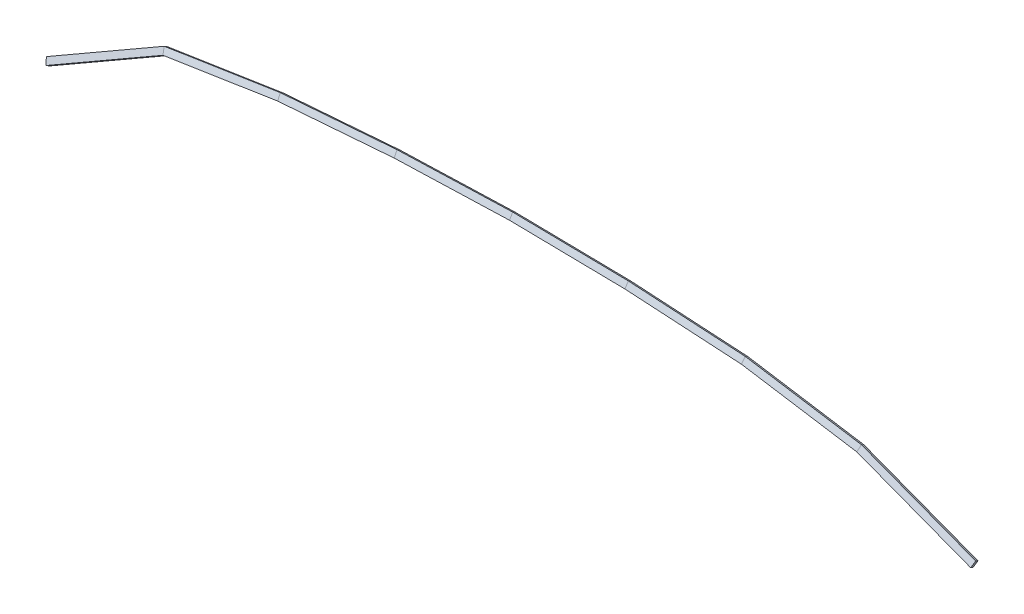
ISO-10303-21;
HEADER;
FILE_DESCRIPTION(('STEP AP214'),'2;1');
FILE_NAME('part.step','',(''),(''),'','','');
FILE_SCHEMA(('AUTOMOTIVE_DESIGN { 1 0 10303 214 1 1 1 1 }'));
ENDSEC;
DATA;
#1=APPLICATION_CONTEXT('core data for automotive mechanical design processes');
#2=APPLICATION_PROTOCOL_DEFINITION('international standard','automotive_design',2000,#1);
#3=PRODUCT_CONTEXT('',#1,'mechanical');
#4=PRODUCT('Part','Part','',(#3));
#5=PRODUCT_RELATED_PRODUCT_CATEGORY('part','',(#4));
#6=PRODUCT_DEFINITION_FORMATION('','',#4);
#7=PRODUCT_DEFINITION_CONTEXT('part definition',#1,'design');
#8=PRODUCT_DEFINITION('design','',#6,#7);
#9=PRODUCT_DEFINITION_SHAPE('','',#8);
#10=(LENGTH_UNIT() NAMED_UNIT(*) SI_UNIT(.MILLI.,.METRE.));
#11=(NAMED_UNIT(*) PLANE_ANGLE_UNIT() SI_UNIT($,.RADIAN.));
#12=(NAMED_UNIT(*) SI_UNIT($,.STERADIAN.) SOLID_ANGLE_UNIT());
#13=UNCERTAINTY_MEASURE_WITH_UNIT(LENGTH_MEASURE(1.E-05),#10,'distance_accuracy_value','');
#14=(GEOMETRIC_REPRESENTATION_CONTEXT(3) GLOBAL_UNCERTAINTY_ASSIGNED_CONTEXT((#13)) GLOBAL_UNIT_ASSIGNED_CONTEXT((#10,
#11,#12)) REPRESENTATION_CONTEXT('',''));
#15=CARTESIAN_POINT('',(0.,0.,0.));
#16=DIRECTION('',(0.,0.,1.));
#17=DIRECTION('',(1.,0.,0.));
#18=AXIS2_PLACEMENT_3D('',#15,#16,#17);
#19=CARTESIAN_POINT('',(-784.907028910568,-160.718556902438,0.));
#20=DIRECTION('',(-0.85855089776077,-0.512728345183076,0.));
#21=DIRECTION('',(0.,0.,1.));
#22=AXIS2_PLACEMENT_3D('',#19,#20,#21);
#23=PLANE('',#22);
#24=DIRECTION('',(0.4440357721689,-0.743526887902763,0.500000000000001));
#25=VECTOR('',#24,1.);
#26=CARTESIAN_POINT('',(-779.465086610704,-169.830954317179,138.5316));
#27=LINE('',#26,#25);
#28=CARTESIAN_POINT('',(-784.066718124844,-162.125636472466,133.35));
#29=VERTEX_POINT('',#28);
#30=CARTESIAN_POINT('',(-779.465086610704,-169.830954317179,138.5316));
#31=VERTEX_POINT('',#30);
#32=EDGE_CURVE('E181',#29,#31,#27,.T.);
#33=ORIENTED_EDGE('',*,*,#32,.F.);
#34=DIRECTION('',(-0.256364172591538,0.429275448880385,0.866025403784439));
#35=VECTOR('',#34,1.);
#36=CARTESIAN_POINT('',(-784.066718124845,-162.125636472466,133.35));
#37=LINE('',#36,#35);
#38=CARTESIAN_POINT('',(-782.705783278225,-164.404488120392,128.75261754147));
#39=VERTEX_POINT('',#38);
#40=EDGE_CURVE('E155',#39,#29,#37,.T.);
#41=ORIENTED_EDGE('',*,*,#40,.F.);
#42=DIRECTION('',(-0.4440357721689,0.743526887902762,-0.500000000000003));
#43=VECTOR('',#42,1.);
#44=CARTESIAN_POINT('',(-782.705783278225,-164.404488120392,128.75261754147));
#45=LINE('',#44,#43);
#46=CARTESIAN_POINT('',(-778.104151764084,-172.109805965106,133.93421754147));
#47=VERTEX_POINT('',#46);
#48=EDGE_CURVE('E139',#47,#39,#45,.T.);
#49=ORIENTED_EDGE('',*,*,#48,.F.);
#50=DIRECTION('',(0.256364172591539,-0.429275448880386,-0.866025403784438));
#51=VECTOR('',#50,1.);
#52=CARTESIAN_POINT('',(-778.104151764084,-172.109805965106,133.93421754147));
#53=LINE('',#52,#51);
#54=EDGE_CURVE('E146',#31,#47,#53,.T.);
#55=ORIENTED_EDGE('',*,*,#54,.F.);
#56=EDGE_LOOP('',(#33,#41,#49,#55));
#57=FACE_BOUND('',#56,.T.);
#58=ADVANCED_FACE('F32',(#57),#23,.T.);
#59=CARTESIAN_POINT('',(734.039201723377,-115.1225877107,0.));
#60=DIRECTION('',(-0.940025323565128,0.341104662906088,0.));
#61=DIRECTION('',(0.,0.,1.));
#62=AXIS2_PLACEMENT_3D('',#59,#60,#61);
#63=PLANE('',#62);
#64=DIRECTION('',(-0.295405303425999,-0.814085810408087,0.500000000000001));
#65=VECTOR('',#64,1.);
#66=CARTESIAN_POINT('',(730.41882085076,-125.099729835398,138.5316));
#67=LINE('',#66,#65);
#68=CARTESIAN_POINT('',(733.480165091224,-116.663195764977,133.35));
#69=VERTEX_POINT('',#68);
#70=CARTESIAN_POINT('',(730.41882085076,-125.099729835398,138.5316));
#71=VERTEX_POINT('',#70);
#72=EDGE_CURVE('E334',#69,#71,#67,.T.);
#73=ORIENTED_EDGE('',*,*,#72,.T.);
#74=DIRECTION('',(-0.170552331453044,-0.470012661782565,-0.866025403784438));
#75=VECTOR('',#74,1.);
#76=CARTESIAN_POINT('',(729.513426744008,-127.594839051737,133.93421754147));
#77=LINE('',#76,#75);
#78=CARTESIAN_POINT('',(729.513426744008,-127.594839051737,133.93421754147));
#79=VERTEX_POINT('',#78);
#80=EDGE_CURVE('E330',#71,#79,#77,.T.);
#81=ORIENTED_EDGE('',*,*,#80,.T.);
#82=DIRECTION('',(0.295405303425999,0.814085810408086,-0.500000000000003));
#83=VECTOR('',#82,1.);
#84=CARTESIAN_POINT('',(732.574770984472,-119.158304981316,128.75261754147));
#85=LINE('',#84,#83);
#86=CARTESIAN_POINT('',(732.574770984472,-119.158304981316,128.75261754147));
#87=VERTEX_POINT('',#86);
#88=EDGE_CURVE('E324',#79,#87,#85,.T.);
#89=ORIENTED_EDGE('',*,*,#88,.T.);
#90=DIRECTION('',(0.170552331453044,0.470012661782564,0.866025403784439));
#91=VECTOR('',#90,1.);
#92=CARTESIAN_POINT('',(733.480165091224,-116.663195764977,133.35));
#93=LINE('',#92,#91);
#94=EDGE_CURVE('E340',#87,#69,#93,.T.);
#95=ORIENTED_EDGE('',*,*,#94,.T.);
#96=EDGE_LOOP('',(#73,#81,#89,#95));
#97=FACE_BOUND('',#96,.T.);
#98=ADVANCED_FACE('F390',(#97),#63,.F.);
#99=CARTESIAN_POINT('',(-590.188768908383,-53.5305624373658,128.75261754147));
#100=DIRECTION('',(-0.24955774335446,0.433322003956346,0.865998252665146));
#101=DIRECTION('',(0.,-0.894293780309085,0.447480317444786));
#102=AXIS2_PLACEMENT_3D('',#99,#100,#101);
#103=PLANE('',#102);
#104=DIRECTION('',(0.288071481331298,-0.820585596833462,0.49361331010525));
#105=VECTOR('',#104,1.);
#106=CARTESIAN_POINT('',(-581.851798674786,-78.8824490882621,143.840506882284));
#107=LINE('',#106,#105);
#108=CARTESIAN_POINT('',(-590.657052794948,-53.8002553422112,128.75261754147));
#109=VERTEX_POINT('',#108);
#110=CARTESIAN_POINT('',(-587.633084119249,-62.4141768907321,133.93421754147));
#111=VERTEX_POINT('',#110);
#112=EDGE_CURVE('E160',#109,#111,#107,.T.);
#113=ORIENTED_EDGE('',*,*,#112,.T.);
#114=DIRECTION('',(-0.866562509147822,-0.49906855014059,0.));
#115=VECTOR('',#114,1.);
#116=CARTESIAN_POINT('',(-585.587137394242,-61.2358802820797,133.93421754147));
#117=LINE('',#116,#115);
#118=EDGE_CURVE('E35',#111,#47,#117,.T.);
#119=ORIENTED_EDGE('',*,*,#118,.T.);
#120=ORIENTED_EDGE('',*,*,#48,.T.);
#121=DIRECTION('',(-0.866562509147822,-0.49906855014059,0.));
#122=VECTOR('',#121,1.);
#123=CARTESIAN_POINT('',(-590.188768908383,-53.5305624373658,128.75261754147));
#124=LINE('',#123,#122);
#125=EDGE_CURVE('E157',#109,#39,#124,.T.);
#126=ORIENTED_EDGE('',*,*,#125,.F.);
#127=EDGE_LOOP('',(#113,#119,#120,#126));
#128=FACE_BOUND('',#127,.T.);
#129=ADVANCED_FACE('F159',(#128),#103,.F.);
#130=CARTESIAN_POINT('',(-591.549703755002,-51.2517107894394,133.35));
#131=DIRECTION('',(0.432219590797591,-0.750488671343633,0.499952977304497));
#132=DIRECTION('',(0.,-0.554413953781299,-0.832241051530497));
#133=AXIS2_PLACEMENT_3D('',#130,#131,#132);
#134=PLANE('',#133);
#135=DIRECTION('',(0.167743514626364,-0.477825543259226,-0.86229047513574));
#136=VECTOR('',#135,1.);
#137=CARTESIAN_POINT('',(-588.558688120008,-59.7775489680914,117.965912156216));
#138=LINE('',#137,#136);
#139=CARTESIAN_POINT('',(-591.551393059525,-51.2526836895477,133.35));
#140=VERTEX_POINT('',#139);
#141=EDGE_CURVE('E191',#140,#109,#138,.T.);
#142=ORIENTED_EDGE('',*,*,#141,.T.);
#143=ORIENTED_EDGE('',*,*,#125,.T.);
#144=ORIENTED_EDGE('',*,*,#40,.T.);
#145=DIRECTION('',(-0.866562509147822,-0.49906855014059,0.));
#146=VECTOR('',#145,1.);
#147=CARTESIAN_POINT('',(-591.549703755002,-51.2517107894394,133.35));
#148=LINE('',#147,#146);
#149=EDGE_CURVE('E183',#140,#29,#148,.T.);
#150=ORIENTED_EDGE('',*,*,#149,.F.);
#151=EDGE_LOOP('',(#142,#143,#144,#150));
#152=FACE_BOUND('',#151,.T.);
#153=ADVANCED_FACE('F189',(#152),#134,.F.);
#154=CARTESIAN_POINT('',(-586.948072240862,-58.9570286341533,138.5316));
#155=DIRECTION('',(0.249557743354459,-0.433322003956344,-0.865998252665147));
#156=DIRECTION('',(0.,0.894293780309086,-0.447480317444783));
#157=AXIS2_PLACEMENT_3D('',#154,#155,#156);
#158=PLANE('',#157);
#159=DIRECTION('',(-0.288071481331298,0.820585596833464,-0.493613310105248));
#160=VECTOR('',#159,1.);
#161=CARTESIAN_POINT('',(-579.772008054505,-84.80683361791,153.534091797151));
#162=LINE('',#161,#160);
#163=CARTESIAN_POINT('',(-588.527424383826,-59.8666052380685,138.5316));
#164=VERTEX_POINT('',#163);
#165=EDGE_CURVE('E196',#164,#140,#162,.T.);
#166=ORIENTED_EDGE('',*,*,#165,.T.);
#167=ORIENTED_EDGE('',*,*,#149,.T.);
#168=ORIENTED_EDGE('',*,*,#32,.T.);
#169=DIRECTION('',(-0.866562509147822,-0.49906855014059,0.));
#170=VECTOR('',#169,1.);
#171=CARTESIAN_POINT('',(-586.948072240862,-58.9570286341533,138.5316));
#172=LINE('',#171,#170);
#173=EDGE_CURVE('E151',#164,#31,#172,.T.);
#174=ORIENTED_EDGE('',*,*,#173,.F.);
#175=EDGE_LOOP('',(#166,#167,#168,#174));
#176=FACE_BOUND('',#175,.T.);
#177=ADVANCED_FACE('F495',(#176),#158,.F.);
#178=CARTESIAN_POINT('',(-585.587137394242,-61.2358802820797,133.93421754147));
#179=DIRECTION('',(-0.43221959079759,0.750488671343633,-0.499952977304499));
#180=DIRECTION('',(0.,0.5544139537813,0.832241051530496));
#181=AXIS2_PLACEMENT_3D('',#178,#179,#180);
#182=PLANE('',#181);
#183=DIRECTION('',(-0.167743514626364,0.477825543259227,0.86229047513574));
#184=VECTOR('',#183,1.);
#185=CARTESIAN_POINT('',(-584.671470887062,-70.8504759318344,118.709957534523));
#186=LINE('',#185,#184);
#187=EDGE_CURVE('E173',#111,#164,#186,.T.);
#188=ORIENTED_EDGE('',*,*,#187,.T.);
#189=ORIENTED_EDGE('',*,*,#173,.T.);
#190=ORIENTED_EDGE('',*,*,#54,.T.);
#191=ORIENTED_EDGE('',*,*,#118,.F.);
#192=EDGE_LOOP('',(#188,#189,#190,#191));
#193=FACE_BOUND('',#192,.T.);
#194=ADVANCED_FACE('F148',(#193),#182,.F.);
#195=CARTESIAN_POINT('',(-400.213670553241,-33.5693686646191,133.93421754147));
#196=DIRECTION('',(-0.131738822515146,0.855974242093003,-0.499952977304498));
#197=DIRECTION('',(0.,0.504348647606648,0.863500110977031));
#198=AXIS2_PLACEMENT_3D('',#195,#196,#197);
#199=PLANE('',#198);
#200=DIRECTION('',(-0.988362936466477,-0.152114121038654,0.));
#201=VECTOR('',#200,1.);
#202=CARTESIAN_POINT('',(-400.213670553241,-33.5693686646191,133.93421754147));
#203=LINE('',#202,#201);
#204=CARTESIAN_POINT('',(-400.83543014905,-33.6650606527787,133.93421754147));
#205=VERTEX_POINT('',#204);
#206=EDGE_CURVE('E178',#205,#111,#203,.T.);
#207=ORIENTED_EDGE('',*,*,#206,.F.);
#208=DIRECTION('',(-0.0571535888943356,0.496950910960597,0.865894485126179));
#209=VECTOR('',#208,1.);
#210=CARTESIAN_POINT('',(-400.626825744216,-35.4788776154188,130.773796521328));
#211=LINE('',#210,#209);
#212=CARTESIAN_POINT('',(-401.138881564364,-31.026548178054,138.5316));
#213=VERTEX_POINT('',#212);
#214=EDGE_CURVE('E210',#205,#213,#211,.T.);
#215=ORIENTED_EDGE('',*,*,#214,.T.);
#216=DIRECTION('',(-0.988362936466477,-0.152114121038654,0.));
#217=VECTOR('',#216,1.);
#218=CARTESIAN_POINT('',(-400.658919237855,-30.9526795163155,138.5316));
#219=LINE('',#218,#217);
#220=EDGE_CURVE('E162',#213,#164,#219,.T.);
#221=ORIENTED_EDGE('',*,*,#220,.T.);
#222=ORIENTED_EDGE('',*,*,#187,.F.);
#223=EDGE_LOOP('',(#207,#215,#221,#222));
#224=FACE_BOUND('',#223,.T.);
#225=ADVANCED_FACE('F209',(#224),#199,.F.);
#226=CARTESIAN_POINT('',(-400.658919237855,-30.9526795163155,138.5316));
#227=DIRECTION('',(0.0760642135595595,-0.494227945179628,-0.865998252665147));
#228=DIRECTION('',(0.,0.868514407363995,-0.495663922634246));
#229=AXIS2_PLACEMENT_3D('',#226,#227,#228);
#230=PLANE('',#229);
#231=ORIENTED_EDGE('',*,*,#220,.F.);
#232=DIRECTION('',(-0.0989630057422614,0.860484123681859,-0.499773345013438));
#233=VECTOR('',#232,1.);
#234=CARTESIAN_POINT('',(-400.513252044295,-36.4664018414393,141.691093344399));
#235=LINE('',#234,#233);
#236=CARTESIAN_POINT('',(-402.164920098973,-22.1051349419199,133.35));
#237=VERTEX_POINT('',#236);
#238=EDGE_CURVE('E224',#213,#237,#235,.T.);
#239=ORIENTED_EDGE('',*,*,#238,.T.);
#240=DIRECTION('',(-0.988362936466477,-0.152114121038654,0.));
#241=VECTOR('',#240,1.);
#242=CARTESIAN_POINT('',(-402.164406722313,-22.1050559306209,133.35));
#243=LINE('',#242,#241);
#244=EDGE_CURVE('E164',#237,#140,#243,.T.);
#245=ORIENTED_EDGE('',*,*,#244,.T.);
#246=ORIENTED_EDGE('',*,*,#165,.F.);
#247=EDGE_LOOP('',(#231,#239,#245,#246));
#248=FACE_BOUND('',#247,.T.);
#249=ADVANCED_FACE('F487',(#248),#230,.F.);
#250=CARTESIAN_POINT('',(-402.164406722313,-22.1050559306209,133.35));
#251=DIRECTION('',(0.131738822515146,-0.855974242093004,0.499952977304497));
#252=DIRECTION('',(0.,-0.504348647606647,-0.863500110977032));
#253=AXIS2_PLACEMENT_3D('',#250,#251,#252);
#254=PLANE('',#253);
#255=ORIENTED_EDGE('',*,*,#244,.F.);
#256=DIRECTION('',(0.0571535888943355,-0.496950910960596,-0.86589448512618));
#257=VECTOR('',#256,1.);
#258=CARTESIAN_POINT('',(-401.956031517079,-23.9214228263704,130.185273609807));
#259=LINE('',#258,#257);
#260=CARTESIAN_POINT('',(-401.861468683658,-24.7436474166446,128.75261754147));
#261=VERTEX_POINT('',#260);
#262=EDGE_CURVE('E201',#237,#261,#259,.T.);
#263=ORIENTED_EDGE('',*,*,#262,.T.);
#264=DIRECTION('',(-0.988362936466477,-0.152114121038654,0.));
#265=VECTOR('',#264,1.);
#266=CARTESIAN_POINT('',(-401.719158037699,-24.7217450789245,128.75261754147));
#267=LINE('',#266,#265);
#268=EDGE_CURVE('E170',#261,#109,#267,.T.);
#269=ORIENTED_EDGE('',*,*,#268,.T.);
#270=ORIENTED_EDGE('',*,*,#141,.F.);
#271=EDGE_LOOP('',(#255,#263,#269,#270));
#272=FACE_BOUND('',#271,.T.);
#273=ADVANCED_FACE('F200',(#272),#254,.F.);
#274=CARTESIAN_POINT('',(-401.719158037699,-24.7217450789245,128.75261754147));
#275=DIRECTION('',(-0.0760642135595598,0.49422794517963,0.865998252665146));
#276=DIRECTION('',(0.,-0.868514407363994,0.495663922634248));
#277=AXIS2_PLACEMENT_3D('',#274,#275,#276);
#278=PLANE('',#277);
#279=ORIENTED_EDGE('',*,*,#268,.F.);
#280=DIRECTION('',(0.0989630057422613,-0.860484123681857,0.49977334501344));
#281=VECTOR('',#280,1.);
#282=CARTESIAN_POINT('',(-401.235376086902,-30.1875275355083,131.914449470704));
#283=LINE('',#282,#281);
#284=EDGE_CURVE('E206',#261,#205,#283,.T.);
#285=ORIENTED_EDGE('',*,*,#284,.T.);
#286=ORIENTED_EDGE('',*,*,#206,.T.);
#287=ORIENTED_EDGE('',*,*,#112,.F.);
#288=EDGE_LOOP('',(#279,#285,#286,#287));
#289=FACE_BOUND('',#288,.T.);
#290=ADVANCED_FACE('F205',(#289),#278,.F.);
#291=CARTESIAN_POINT('',(-210.345153947005,-19.1016276043959,133.93421754147));
#292=DIRECTION('',(-0.0660191113265195,0.86353256882646,-0.499952977304498));
#293=DIRECTION('',(0.,0.501046080130912,0.865420606171039));
#294=AXIS2_PLACEMENT_3D('',#291,#292,#293);
#295=PLANE('',#294);
#296=DIRECTION('',(-0.997090266843599,-0.0762299138511886,0.));
#297=VECTOR('',#296,1.);
#298=CARTESIAN_POINT('',(-210.345153947005,-19.1016276043959,133.93421754147));
#299=LINE('',#298,#297);
#300=CARTESIAN_POINT('',(-210.779861167201,-19.1348620015692,133.93421754147));
#301=VERTEX_POINT('',#300);
#302=EDGE_CURVE('E215',#301,#205,#299,.T.);
#303=ORIENTED_EDGE('',*,*,#302,.F.);
#304=DIRECTION('',(-0.0273290341594202,0.499293276973071,0.86600193271228));
#305=VECTOR('',#304,1.);
#306=CARTESIAN_POINT('',(-210.724080433556,-20.1539593151073,132.166638677809));
#307=LINE('',#306,#305);
#308=CARTESIAN_POINT('',(-210.924944009983,-16.4842418741652,138.5316));
#309=VERTEX_POINT('',#308);
#310=EDGE_CURVE('E232',#301,#309,#307,.T.);
#311=ORIENTED_EDGE('',*,*,#310,.T.);
#312=DIRECTION('',(-0.997090266843599,-0.0762299138511886,0.));
#313=VECTOR('',#312,1.);
#314=CARTESIAN_POINT('',(-210.589375262573,-16.4585868481793,138.5316));
#315=LINE('',#314,#313);
#316=EDGE_CURVE('E195',#309,#213,#315,.T.);
#317=ORIENTED_EDGE('',*,*,#316,.T.);
#318=ORIENTED_EDGE('',*,*,#214,.F.);
#319=EDGE_LOOP('',(#303,#311,#317,#318));
#320=FACE_BOUND('',#319,.T.);
#321=ADVANCED_FACE('F478',(#320),#295,.F.);
#322=CARTESIAN_POINT('',(-210.589375262573,-16.4585868481793,138.5316));
#323=DIRECTION('',(0.0381185415739948,-0.498592020763653,-0.865998252665147));
#324=DIRECTION('',(0.,0.866628096913272,-0.498954648881519));
#325=AXIS2_PLACEMENT_3D('',#322,#323,#324);
#326=PLANE('',#325);
#327=ORIENTED_EDGE('',*,*,#316,.F.);
#328=DIRECTION('',(-0.047332710162327,0.86475445224685,-0.499959350215535));
#329=VECTOR('',#328,1.);
#330=CARTESIAN_POINT('',(-210.75760633086,-19.5414512026457,140.299131101307));
#331=LINE('',#330,#329);
#332=CARTESIAN_POINT('',(-211.415502234109,-7.52188989928847,133.35));
#333=VERTEX_POINT('',#332);
#334=EDGE_CURVE('E246',#309,#333,#331,.T.);
#335=ORIENTED_EDGE('',*,*,#334,.T.);
#336=DIRECTION('',(-0.997090266843599,-0.0762299138511886,0.));
#337=VECTOR('',#336,1.);
#338=CARTESIAN_POINT('',(-211.415143303516,-7.52186245819396,133.35));
#339=LINE('',#338,#337);
#340=EDGE_CURVE('E219',#333,#237,#339,.T.);
#341=ORIENTED_EDGE('',*,*,#340,.T.);
#342=ORIENTED_EDGE('',*,*,#238,.F.);
#343=EDGE_LOOP('',(#327,#335,#341,#342));
#344=FACE_BOUND('',#343,.T.);
#345=ADVANCED_FACE('F474',(#344),#326,.F.);
#346=CARTESIAN_POINT('',(-211.415143303516,-7.52186245819396,133.35));
#347=DIRECTION('',(0.0660191113265195,-0.86353256882646,0.499952977304497));
#348=DIRECTION('',(0.,-0.501046080130911,-0.865420606171039));
#349=AXIS2_PLACEMENT_3D('',#346,#347,#348);
#350=PLANE('',#349);
#351=ORIENTED_EDGE('',*,*,#340,.F.);
#352=DIRECTION('',(0.0273290341594201,-0.49929327697307,-0.866001932712281));
#353=VECTOR('',#352,1.);
#354=CARTESIAN_POINT('',(-211.359701611548,-8.54135057738178,131.581790896715));
#355=LINE('',#354,#353);
#356=CARTESIAN_POINT('',(-211.270419391327,-10.1725100266925,128.75261754147));
#357=VERTEX_POINT('',#356);
#358=EDGE_CURVE('E249',#333,#357,#355,.T.);
#359=ORIENTED_EDGE('',*,*,#358,.T.);
#360=DIRECTION('',(-0.997090266843599,-0.0762299138511886,0.));
#361=VECTOR('',#360,1.);
#362=CARTESIAN_POINT('',(-211.170921987947,-10.1649032144106,128.75261754147));
#363=LINE('',#362,#361);
#364=EDGE_CURVE('E217',#357,#261,#363,.T.);
#365=ORIENTED_EDGE('',*,*,#364,.T.);
#366=ORIENTED_EDGE('',*,*,#262,.F.);
#367=EDGE_LOOP('',(#351,#359,#365,#366));
#368=FACE_BOUND('',#367,.T.);
#369=ADVANCED_FACE('F470',(#368),#350,.F.);
#370=CARTESIAN_POINT('',(-211.170921987947,-10.1649032144106,128.75261754147));
#371=DIRECTION('',(-0.038118541573995,0.498592020763656,0.865998252665146));
#372=DIRECTION('',(0.,-0.866628096913271,0.498954648881521));
#373=AXIS2_PLACEMENT_3D('',#370,#371,#372);
#374=PLANE('',#373);
#375=ORIENTED_EDGE('',*,*,#364,.F.);
#376=DIRECTION('',(0.047332710162327,-0.864754452246848,0.499959350215537));
#377=VECTOR('',#376,1.);
#378=CARTESIAN_POINT('',(-211.103049286421,-13.2303117645104,130.520491145307));
#379=LINE('',#378,#377);
#380=EDGE_CURVE('E229',#357,#301,#379,.T.);
#381=ORIENTED_EDGE('',*,*,#380,.T.);
#382=ORIENTED_EDGE('',*,*,#302,.T.);
#383=ORIENTED_EDGE('',*,*,#284,.F.);
#384=EDGE_LOOP('',(#375,#381,#382,#383));
#385=FACE_BOUND('',#384,.T.);
#386=ADVANCED_FACE('F466',(#385),#374,.F.);
#387=CARTESIAN_POINT('',(-22.0963943809189,-12.8951278215918,133.93421754147));
#388=DIRECTION('',(-0.0286245811651829,0.865579374660398,-0.499952977304498));
#389=DIRECTION('',(0.,0.500157925656291,0.86593420616303));
#390=AXIS2_PLACEMENT_3D('',#387,#388,#389);
#391=PLANE('',#390);
#392=DIRECTION('',(-0.999453640558516,-0.0330517832246514,0.));
#393=VECTOR('',#392,1.);
#394=CARTESIAN_POINT('',(-22.0963943809189,-12.8951278215918,133.93421754147));
#395=LINE('',#394,#393);
#396=CARTESIAN_POINT('',(-22.5649935605436,-12.9106243267579,133.93421754147));
#397=VERTEX_POINT('',#396);
#398=EDGE_CURVE('E233',#397,#301,#395,.T.);
#399=ORIENTED_EDGE('',*,*,#398,.F.);
#400=DIRECTION('',(-0.00430594003837549,0.500046509982729,0.865987844449608));
#401=VECTOR('',#400,1.);
#402=CARTESIAN_POINT('',(-22.5550584801441,-14.0643798913724,131.936126814956));
#403=LINE('',#402,#401);
#404=CARTESIAN_POINT('',(-22.5878530652431,-10.2559622917441,138.5316));
#405=VERTEX_POINT('',#404);
#406=EDGE_CURVE('E256',#397,#405,#403,.T.);
#407=ORIENTED_EDGE('',*,*,#406,.T.);
#408=DIRECTION('',(-0.999453640558516,-0.0330517832246514,0.));
#409=VECTOR('',#408,1.);
#410=CARTESIAN_POINT('',(-22.2261216919448,-10.2439998890367,138.5316));
#411=LINE('',#410,#409);
#412=EDGE_CURVE('E228',#405,#309,#411,.T.);
#413=ORIENTED_EDGE('',*,*,#412,.T.);
#414=ORIENTED_EDGE('',*,*,#310,.F.);
#415=EDGE_LOOP('',(#399,#407,#413,#414));
#416=FACE_BOUND('',#415,.T.);
#417=ADVANCED_FACE('F462',(#416),#391,.F.);
#418=CARTESIAN_POINT('',(-22.2261216919448,-10.2439998890367,138.5316));
#419=DIRECTION('',(0.0165274458449869,-0.499773818756798,-0.865998252665147));
#420=DIRECTION('',(0.,0.866116553412859,-0.499842090968969));
#421=AXIS2_PLACEMENT_3D('',#418,#419,#420);
#422=PLANE('',#421);
#423=ORIENTED_EDGE('',*,*,#412,.F.);
#424=DIRECTION('',(-0.00745746010601862,0.866030847182192,-0.499934953786653));
#425=VECTOR('',#424,1.);
#426=CARTESIAN_POINT('',(-22.5580493841578,-13.7170478104768,140.52958613928));
#427=LINE('',#426,#425);
#428=CARTESIAN_POINT('',(-22.6651462710745,-1.27994370418552,133.35));
#429=VERTEX_POINT('',#428);
#430=EDGE_CURVE('E270',#405,#429,#427,.T.);
#431=ORIENTED_EDGE('',*,*,#430,.T.);
#432=DIRECTION('',(-0.999453640558516,-0.0330517832246514,0.));
#433=VECTOR('',#432,1.);
#434=CARTESIAN_POINT('',(-22.6647593564477,-1.27993090897637,133.35));
#435=LINE('',#434,#433);
#436=EDGE_CURVE('E239',#429,#333,#435,.T.);
#437=ORIENTED_EDGE('',*,*,#436,.T.);
#438=ORIENTED_EDGE('',*,*,#334,.F.);
#439=EDGE_LOOP('',(#423,#431,#437,#438));
#440=FACE_BOUND('',#439,.T.);
#441=ADVANCED_FACE('F458',(#440),#422,.F.);
#442=CARTESIAN_POINT('',(-22.6647593564477,-1.27993090897637,133.35));
#443=DIRECTION('',(0.028624581165183,-0.865579374660399,0.499952977304497));
#444=DIRECTION('',(0.,-0.500157925656289,-0.86593420616303));
#445=AXIS2_PLACEMENT_3D('',#442,#443,#444);
#446=PLANE('',#445);
#447=ORIENTED_EDGE('',*,*,#436,.F.);
#448=DIRECTION('',(0.00430594003837548,-0.500046509982728,-0.865987844449609));
#449=VECTOR('',#448,1.);
#450=CARTESIAN_POINT('',(-22.6552059184632,-2.43431152793466,131.35084895418));
#451=LINE('',#450,#449);
#452=CARTESIAN_POINT('',(-22.642286766375,-3.93460573919927,128.75261754147));
#453=VERTEX_POINT('',#452);
#454=EDGE_CURVE('E273',#429,#453,#451,.T.);
#455=ORIENTED_EDGE('',*,*,#454,.T.);
#456=DIRECTION('',(-0.999453640558516,-0.0330517832246514,0.));
#457=VECTOR('',#456,1.);
#458=CARTESIAN_POINT('',(-22.5350320454218,-3.93105884153148,128.75261754147));
#459=LINE('',#458,#457);
#460=EDGE_CURVE('E236',#453,#357,#459,.T.);
#461=ORIENTED_EDGE('',*,*,#460,.T.);
#462=ORIENTED_EDGE('',*,*,#358,.F.);
#463=EDGE_LOOP('',(#447,#455,#461,#462));
#464=FACE_BOUND('',#463,.T.);
#465=ADVANCED_FACE('F454',(#464),#446,.F.);
#466=CARTESIAN_POINT('',(-22.5350320454218,-3.93105884153148,128.75261754147));
#467=DIRECTION('',(-0.016527445844987,0.4997738187568,0.865998252665146));
#468=DIRECTION('',(0.,-0.866116553412857,0.499842090968971));
#469=AXIS2_PLACEMENT_3D('',#466,#467,#468);
#470=PLANE('',#469);
#471=ORIENTED_EDGE('',*,*,#460,.F.);
#472=DIRECTION('',(0.0074574601060186,-0.86603084718219,0.499934953786655));
#473=VECTOR('',#472,1.);
#474=CARTESIAN_POINT('',(-22.6124744903283,-7.39668938619232,130.75117987178));
#475=LINE('',#474,#473);
#476=EDGE_CURVE('E253',#453,#397,#475,.T.);
#477=ORIENTED_EDGE('',*,*,#476,.T.);
#478=ORIENTED_EDGE('',*,*,#398,.T.);
#479=ORIENTED_EDGE('',*,*,#380,.F.);
#480=EDGE_LOOP('',(#471,#477,#478,#479));
#481=FACE_BOUND('',#480,.T.);
#482=ADVANCED_FACE('F450',(#481),#470,.F.);
#483=CARTESIAN_POINT('',(166.165138103158,-15.8996180390846,133.93421754147));
#484=DIRECTION('',(0.0137142968276027,0.865943958086718,-0.499952977304498));
#485=DIRECTION('',(0.,0.500000000000001,0.866025403784438));
#486=AXIS2_PLACEMENT_3D('',#483,#484,#485);
#487=PLANE('',#486);
#488=DIRECTION('',(-0.99987461204119,0.0158354095456876,0.));
#489=VECTOR('',#488,1.);
#490=CARTESIAN_POINT('',(166.165138103158,-15.8996180390846,133.93421754147));
#491=LINE('',#490,#489);
#492=CARTESIAN_POINT('',(165.729826551718,-15.8927238379378,133.93421754147));
#493=VERTEX_POINT('',#492);
#494=EDGE_CURVE('E257',#493,#397,#491,.T.);
#495=ORIENTED_EDGE('',*,*,#494,.F.);
#496=DIRECTION('',(0.0187005298690764,0.499690422687469,0.866002177628345));
#497=VECTOR('',#496,1.);
#498=CARTESIAN_POINT('',(165.691257760709,-16.9233072287297,132.148136759987));
#499=LINE('',#498,#497);
#500=CARTESIAN_POINT('',(165.829102847097,-13.239996115878,138.5316));
#501=VERTEX_POINT('',#500);
#502=EDGE_CURVE('E280',#493,#501,#499,.T.);
#503=ORIENTED_EDGE('',*,*,#502,.T.);
#504=DIRECTION('',(-0.99987461204119,0.0158354095456876,0.));
#505=VECTOR('',#504,1.);
#506=CARTESIAN_POINT('',(166.165138103158,-13.2453180390846,138.5316));
#507=LINE('',#506,#505);
#508=EDGE_CURVE('E252',#501,#405,#507,.T.);
#509=ORIENTED_EDGE('',*,*,#508,.T.);
#510=ORIENTED_EDGE('',*,*,#406,.F.);
#511=EDGE_LOOP('',(#495,#503,#509,#510));
#512=FACE_BOUND('',#511,.T.);
#513=ADVANCED_FACE('F446',(#512),#487,.F.);
#514=CARTESIAN_POINT('',(166.165138103158,-13.2453180390846,138.5316));
#515=DIRECTION('',(-0.0079184494198286,-0.49998432429397,-0.865998252665147));
#516=DIRECTION('',(0.,0.866025403784438,-0.500000000000001));
#517=AXIS2_PLACEMENT_3D('',#514,#515,#516);
#518=PLANE('',#517);
#519=ORIENTED_EDGE('',*,*,#508,.F.);
#520=DIRECTION('',(0.0323885306590623,0.865442780956462,-0.49995977435399));
#521=VECTOR('',#520,1.);
#522=CARTESIAN_POINT('',(165.713399673962,-16.3316607850182,140.317631386908));
#523=LINE('',#522,#521);
#524=CARTESIAN_POINT('',(166.164778673577,-4.27051788215739,133.35));
#525=VERTEX_POINT('',#524);
#526=EDGE_CURVE('E294',#501,#525,#523,.T.);
#527=ORIENTED_EDGE('',*,*,#526,.T.);
#528=DIRECTION('',(-0.99987461204119,0.0158354095456876,0.));
#529=VECTOR('',#528,1.);
#530=CARTESIAN_POINT('',(166.165138103158,-4.27052357458575,133.35));
#531=LINE('',#530,#529);
#532=EDGE_CURVE('E263',#525,#429,#531,.T.);
#533=ORIENTED_EDGE('',*,*,#532,.T.);
#534=ORIENTED_EDGE('',*,*,#430,.F.);
#535=EDGE_LOOP('',(#519,#527,#533,#534));
#536=FACE_BOUND('',#535,.T.);
#537=ADVANCED_FACE('F442',(#536),#518,.F.);
#538=CARTESIAN_POINT('',(166.165138103158,-4.27052357458575,133.35));
#539=DIRECTION('',(-0.0137142968276027,-0.865943958086719,0.499952977304497));
#540=DIRECTION('',(0.,-0.5,-0.866025403784439));
#541=AXIS2_PLACEMENT_3D('',#538,#539,#540);
#542=PLANE('',#541);
#543=ORIENTED_EDGE('',*,*,#532,.F.);
#544=DIRECTION('',(-0.0187005298690764,-0.499690422687467,-0.866002177628345));
#545=VECTOR('',#544,1.);
#546=CARTESIAN_POINT('',(166.126196428937,-5.30146076279784,131.563296194785));
#547=LINE('',#546,#545);
#548=CARTESIAN_POINT('',(166.065502378198,-6.92324560421714,128.75261754147));
#549=VERTEX_POINT('',#548);
#550=EDGE_CURVE('E297',#525,#549,#547,.T.);
#551=ORIENTED_EDGE('',*,*,#550,.T.);
#552=DIRECTION('',(-0.99987461204119,0.0158354095456876,0.));
#553=VECTOR('',#552,1.);
#554=CARTESIAN_POINT('',(166.165138103158,-6.92482357458575,128.75261754147));
#555=LINE('',#554,#553);
#556=EDGE_CURVE('E260',#549,#453,#555,.T.);
#557=ORIENTED_EDGE('',*,*,#556,.T.);
#558=ORIENTED_EDGE('',*,*,#454,.F.);
#559=EDGE_LOOP('',(#543,#551,#557,#558));
#560=FACE_BOUND('',#559,.T.);
#561=ADVANCED_FACE('F438',(#560),#542,.F.);
#562=CARTESIAN_POINT('',(166.165138103158,-6.92482357458575,128.75261754147));
#563=DIRECTION('',(0.00791844941982863,0.499984324293972,0.865998252665146));
#564=DIRECTION('',(0.,-0.866025403784437,0.500000000000003));
#565=AXIS2_PLACEMENT_3D('',#562,#563,#564);
#566=PLANE('',#565);
#567=ORIENTED_EDGE('',*,*,#556,.F.);
#568=DIRECTION('',(-0.0323885306590622,-0.865442780956461,0.499959774353993));
#569=VECTOR('',#568,1.);
#570=CARTESIAN_POINT('',(165.949777270987,-10.0154963662517,130.538987509828));
#571=LINE('',#570,#569);
#572=EDGE_CURVE('E277',#549,#493,#571,.T.);
#573=ORIENTED_EDGE('',*,*,#572,.T.);
#574=ORIENTED_EDGE('',*,*,#494,.T.);
#575=ORIENTED_EDGE('',*,*,#476,.F.);
#576=EDGE_LOOP('',(#567,#573,#574,#575));
#577=FACE_BOUND('',#576,.T.);
#578=ADVANCED_FACE('F434',(#577),#566,.F.);
#579=CARTESIAN_POINT('',(356.6231804475,-27.1642038659458,133.93421754147));
#580=DIRECTION('',(0.0510479882650096,0.864546773389655,-0.499952977304498));
#581=DIRECTION('',(0.,0.500605666220314,0.865675439727913));
#582=AXIS2_PLACEMENT_3D('',#579,#580,#581);
#583=PLANE('',#582);
#584=DIRECTION('',(-0.998261332689934,0.0589432918669874,0.));
#585=VECTOR('',#584,1.);
#586=CARTESIAN_POINT('',(356.6231804475,-27.1642038659458,133.93421754147));
#587=LINE('',#586,#585);
#588=CARTESIAN_POINT('',(355.869985519348,-27.1197307535162,133.93421754147));
#589=VERTEX_POINT('',#588);
#590=EDGE_CURVE('E281',#589,#493,#587,.T.);
#591=ORIENTED_EDGE('',*,*,#590,.F.);
#592=DIRECTION('',(0.0539068659073253,0.497490558577499,0.865792812360035));
#593=VECTOR('',#592,1.);
#594=CARTESIAN_POINT('',(355.617015515561,-29.4543162718777,129.871291468226));
#595=LINE('',#594,#593);
#596=CARTESIAN_POINT('',(356.15623238601,-24.4780428870461,138.5316));
#597=VERTEX_POINT('',#596);
#598=EDGE_CURVE('E304',#589,#597,#595,.T.);
#599=ORIENTED_EDGE('',*,*,#598,.T.);
#600=DIRECTION('',(-0.998261332689934,0.0589432918669874,0.));
#601=VECTOR('',#600,1.);
#602=CARTESIAN_POINT('',(356.737655161739,-24.5123735490137,138.5316));
#603=LINE('',#602,#601);
#604=EDGE_CURVE('E276',#597,#501,#603,.T.);
#605=ORIENTED_EDGE('',*,*,#604,.T.);
#606=ORIENTED_EDGE('',*,*,#502,.F.);
#607=EDGE_LOOP('',(#591,#599,#605,#606));
#608=FACE_BOUND('',#607,.T.);
#609=ADVANCED_FACE('F430',(#608),#583,.F.);
#610=CARTESIAN_POINT('',(356.737655161739,-24.5123735490137,138.5316));
#611=DIRECTION('',(-0.0294744176928496,-0.49917760875522,-0.865998252665147));
#612=DIRECTION('',(0.,0.866374662157951,-0.499394578235184));
#613=AXIS2_PLACEMENT_3D('',#610,#611,#612);
#614=PLANE('',#613);
#615=ORIENTED_EDGE('',*,*,#604,.F.);
#616=DIRECTION('',(0.0933193246266702,0.86121651023842,-0.499597464108836));
#617=VECTOR('',#616,1.);
#618=CARTESIAN_POINT('',(355.397788508296,-31.477497632245,142.592030564525));
#619=LINE('',#618,#617);
#620=CARTESIAN_POINT('',(357.124098412608,-15.5458929262544,133.35));
#621=VERTEX_POINT('',#620);
#622=EDGE_CURVE('E318',#597,#621,#619,.T.);
#623=ORIENTED_EDGE('',*,*,#622,.T.);
#624=DIRECTION('',(-0.998261332689934,0.0589432918669874,0.));
#625=VECTOR('',#624,1.);
#626=CARTESIAN_POINT('',(357.124720313259,-15.545929646971,133.35));
#627=LINE('',#626,#625);
#628=EDGE_CURVE('E287',#621,#525,#627,.T.);
#629=ORIENTED_EDGE('',*,*,#628,.T.);
#630=ORIENTED_EDGE('',*,*,#526,.F.);
#631=EDGE_LOOP('',(#615,#623,#629,#630));
#632=FACE_BOUND('',#631,.T.);
#633=ADVANCED_FACE('F426',(#632),#614,.F.);
#634=CARTESIAN_POINT('',(357.124720313259,-15.545929646971,133.35));
#635=DIRECTION('',(-0.0510479882650097,-0.864546773389656,0.499952977304497));
#636=DIRECTION('',(0.,-0.500605666220313,-0.865675439727914));
#637=AXIS2_PLACEMENT_3D('',#634,#635,#636);
#638=PLANE('',#637);
#639=ORIENTED_EDGE('',*,*,#628,.F.);
#640=DIRECTION('',(-0.0539068659073251,-0.497490558577497,-0.865792812360035));
#641=VECTOR('',#640,1.);
#642=CARTESIAN_POINT('',(356.870619385338,-17.8851760721398,129.278898551213));
#643=LINE('',#642,#641);
#644=CARTESIAN_POINT('',(356.837851545946,-18.1875807927244,128.75261754147));
#645=VERTEX_POINT('',#644);
#646=EDGE_CURVE('E321',#621,#645,#643,.T.);
#647=ORIENTED_EDGE('',*,*,#646,.T.);
#648=DIRECTION('',(-0.998261332689934,0.0589432918669874,0.));
#649=VECTOR('',#648,1.);
#650=CARTESIAN_POINT('',(357.01024559902,-18.197759963903,128.75261754147));
#651=LINE('',#650,#649);
#652=EDGE_CURVE('E284',#645,#549,#651,.T.);
#653=ORIENTED_EDGE('',*,*,#652,.T.);
#654=ORIENTED_EDGE('',*,*,#550,.F.);
#655=EDGE_LOOP('',(#639,#647,#653,#654));
#656=FACE_BOUND('',#655,.T.);
#657=ADVANCED_FACE('F422',(#656),#638,.F.);
#658=CARTESIAN_POINT('',(357.01024559902,-18.197759963903,128.75261754147));
#659=DIRECTION('',(0.0294744176928497,0.499177608755222,0.865998252665146));
#660=DIRECTION('',(0.,-0.866374662157949,0.499394578235186));
#661=AXIS2_PLACEMENT_3D('',#658,#659,#660);
#662=PLANE('',#661);
#663=ORIENTED_EDGE('',*,*,#652,.F.);
#664=DIRECTION('',(-0.0933193246266701,-0.861216510238419,0.499597464108839));
#665=VECTOR('',#664,1.);
#666=CARTESIAN_POINT('',(356.078578585283,-25.1946868998106,132.817486712258));
#667=LINE('',#666,#665);
#668=EDGE_CURVE('E301',#645,#589,#667,.T.);
#669=ORIENTED_EDGE('',*,*,#668,.T.);
#670=ORIENTED_EDGE('',*,*,#590,.T.);
#671=ORIENTED_EDGE('',*,*,#572,.F.);
#672=EDGE_LOOP('',(#663,#669,#670,#671));
#673=FACE_BOUND('',#672,.T.);
#674=ADVANCED_FACE('F419',(#673),#662,.F.);
#675=CARTESIAN_POINT('',(545.138876964675,-57.0612356921773,133.93421754147));
#676=DIRECTION('',(0.135322877419438,0.855414951547663,-0.499952977304498));
#677=DIRECTION('',(0.,0.504594462361509,0.863356489843042));
#678=AXIS2_PLACEMENT_3D('',#675,#676,#677);
#679=PLANE('',#678);
#680=DIRECTION('',(-0.987717143616008,0.156252501442487,0.));
#681=VECTOR('',#680,1.);
#682=CARTESIAN_POINT('',(545.138876964675,-57.0612356921773,133.93421754147));
#683=LINE('',#682,#681);
#684=CARTESIAN_POINT('',(543.762721568859,-56.8435339702221,133.93421754147));
#685=VERTEX_POINT('',#684);
#686=EDGE_CURVE('E305',#685,#589,#683,.T.);
#687=ORIENTED_EDGE('',*,*,#686,.F.);
#688=DIRECTION('',(0.129245631261355,0.485042746965428,0.864886755833436));
#689=VECTOR('',#688,1.);
#690=CARTESIAN_POINT('',(542.430206836791,-61.8442956958338,125.017286791305));
#691=LINE('',#690,#689);
#692=CARTESIAN_POINT('',(544.449738214674,-54.265246117511,138.5316));
#693=VERTEX_POINT('',#692);
#694=EDGE_CURVE('E328',#685,#693,#691,.T.);
#695=ORIENTED_EDGE('',*,*,#694,.T.);
#696=DIRECTION('',(-0.987717143616008,0.156252501442487,0.));
#697=VECTOR('',#696,1.);
#698=CARTESIAN_POINT('',(545.512050320297,-54.4332992133685,138.5316));
#699=LINE('',#698,#697);
#700=EDGE_CURVE('E300',#693,#597,#699,.T.);
#701=ORIENTED_EDGE('',*,*,#700,.T.);
#702=ORIENTED_EDGE('',*,*,#598,.F.);
#703=EDGE_LOOP('',(#687,#695,#701,#702));
#704=FACE_BOUND('',#703,.T.);
#705=ADVANCED_FACE('F380',(#704),#679,.F.);
#706=CARTESIAN_POINT('',(545.512050320297,-54.4332992133685,138.5316));
#707=DIRECTION('',(-0.078133598365378,-0.493905018386521,-0.865998252665147));
#708=DIRECTION('',(0.,0.868653816449204,-0.495419566799932));
#709=AXIS2_PLACEMENT_3D('',#706,#707,#708);
#710=PLANE('',#709);
#711=ORIENTED_EDGE('',*,*,#700,.F.);
#712=DIRECTION('',(0.223274034641962,0.83791962662008,-0.498035545698865));
#713=VECTOR('',#712,1.);
#714=CARTESIAN_POINT('',(540.468419060659,-69.2066407330448,147.412339135883));
#715=LINE('',#714,#713);
#716=CARTESIAN_POINT('',(546.772698388686,-45.5474660819473,133.35));
#717=VERTEX_POINT('',#716);
#718=EDGE_CURVE('E41',#693,#717,#715,.T.);
#719=ORIENTED_EDGE('',*,*,#718,.T.);
#720=DIRECTION('',(-0.987717143616008,0.156252501442487,0.));
#721=VECTOR('',#720,1.);
#722=CARTESIAN_POINT('',(546.773834657537,-45.5476458346745,133.35));
#723=LINE('',#722,#721);
#724=EDGE_CURVE('E311',#717,#621,#723,.T.);
#725=ORIENTED_EDGE('',*,*,#724,.T.);
#726=ORIENTED_EDGE('',*,*,#622,.F.);
#727=EDGE_LOOP('',(#711,#719,#725,#726));
#728=FACE_BOUND('',#727,.T.);
#729=ADVANCED_FACE('F356',(#728),#710,.F.);
#730=CARTESIAN_POINT('',(546.773834657537,-45.5476458346745,133.35));
#731=DIRECTION('',(-0.135322877419438,-0.855414951547664,0.499952977304497));
#732=DIRECTION('',(0.,-0.504594462361508,-0.863356489843043));
#733=AXIS2_PLACEMENT_3D('',#730,#731,#732);
#734=PLANE('',#733);
#735=ORIENTED_EDGE('',*,*,#724,.F.);
#736=DIRECTION('',(-0.129245631261355,-0.485042746965426,-0.864886755833437));
#737=VECTOR('',#736,1.);
#738=CARTESIAN_POINT('',(545.433320162726,-50.5739856447753,124.387140076775));
#739=LINE('',#738,#737);
#740=CARTESIAN_POINT('',(546.085681742871,-48.1257539346585,128.75261754147));
#741=VERTEX_POINT('',#740);
#742=EDGE_CURVE('E11',#717,#741,#739,.T.);
#743=ORIENTED_EDGE('',*,*,#742,.T.);
#744=DIRECTION('',(-0.987717143616008,0.156252501442487,0.));
#745=VECTOR('',#744,1.);
#746=CARTESIAN_POINT('',(546.400661301915,-48.1755823134833,128.75261754147));
#747=LINE('',#746,#745);
#748=EDGE_CURVE('E308',#741,#645,#747,.T.);
#749=ORIENTED_EDGE('',*,*,#748,.T.);
#750=ORIENTED_EDGE('',*,*,#646,.F.);
#751=EDGE_LOOP('',(#735,#743,#749,#750));
#752=FACE_BOUND('',#751,.T.);
#753=ADVANCED_FACE('F411',(#752),#734,.F.);
#754=CARTESIAN_POINT('',(546.400661301915,-48.1755823134833,128.75261754147));
#755=DIRECTION('',(0.0781335983653784,0.493905018386523,0.865998252665146));
#756=DIRECTION('',(0.,-0.868653816449203,0.495419566799935));
#757=AXIS2_PLACEMENT_3D('',#754,#755,#756);
#758=PLANE('',#757);
#759=ORIENTED_EDGE('',*,*,#748,.F.);
#760=DIRECTION('',(-0.223274034641962,-0.837919626620078,0.498035545698867));
#761=VECTOR('',#760,1.);
#762=CARTESIAN_POINT('',(542.093230027306,-63.1089276662989,137.658188993279));
#763=LINE('',#762,#761);
#764=EDGE_CURVE('E325',#741,#685,#763,.T.);
#765=ORIENTED_EDGE('',*,*,#764,.T.);
#766=ORIENTED_EDGE('',*,*,#686,.T.);
#767=ORIENTED_EDGE('',*,*,#668,.F.);
#768=EDGE_LOOP('',(#759,#765,#766,#767));
#769=FACE_BOUND('',#768,.T.);
#770=ADVANCED_FACE('F384',(#769),#758,.F.);
#771=CARTESIAN_POINT('',(729.513426744008,-127.594839051737,133.93421754147));
#772=DIRECTION('',(0.308269308231569,0.809331238793362,-0.499952977304498));
#773=DIRECTION('',(0.,0.525547603116574,0.850764195801883));
#774=AXIS2_PLACEMENT_3D('',#771,#772,#773);
#775=PLANE('',#774);
#776=DIRECTION('',(-0.934505923673515,0.355947578470637,0.));
#777=VECTOR('',#776,1.);
#778=CARTESIAN_POINT('',(729.513426744008,-127.594839051737,133.93421754147));
#779=LINE('',#778,#777);
#780=EDGE_CURVE('E333',#79,#685,#779,.T.);
#781=ORIENTED_EDGE('',*,*,#780,.F.);
#782=ORIENTED_EDGE('',*,*,#80,.F.);
#783=DIRECTION('',(-0.934505923673515,0.355947578470637,0.));
#784=VECTOR('',#783,1.);
#785=CARTESIAN_POINT('',(730.41882085076,-125.099729835398,138.5316));
#786=LINE('',#785,#784);
#787=EDGE_CURVE('E329',#71,#693,#786,.T.);
#788=ORIENTED_EDGE('',*,*,#787,.T.);
#789=ORIENTED_EDGE('',*,*,#694,.F.);
#790=EDGE_LOOP('',(#781,#782,#788,#789));
#791=FACE_BOUND('',#790,.T.);
#792=ADVANCED_FACE('F378',(#791),#775,.F.);
#793=CARTESIAN_POINT('',(730.41882085076,-125.099729835398,138.5316));
#794=DIRECTION('',(-0.177990527374631,-0.467296906201841,-0.865998252665147));
#795=DIRECTION('',(0.,0.880050725963897,-0.47487968974301));
#796=AXIS2_PLACEMENT_3D('',#793,#794,#795);
#797=PLANE('',#796);
#798=ORIENTED_EDGE('',*,*,#787,.F.);
#799=ORIENTED_EDGE('',*,*,#72,.F.);
#800=DIRECTION('',(-0.934505923673515,0.355947578470637,0.));
#801=VECTOR('',#800,1.);
#802=CARTESIAN_POINT('',(733.480165091224,-116.663195764977,133.35));
#803=LINE('',#802,#801);
#804=EDGE_CURVE('E337',#69,#717,#803,.T.);
#805=ORIENTED_EDGE('',*,*,#804,.T.);
#806=ORIENTED_EDGE('',*,*,#718,.F.);
#807=EDGE_LOOP('',(#798,#799,#805,#806));
#808=FACE_BOUND('',#807,.T.);
#809=ADVANCED_FACE('F360',(#808),#797,.F.);
#810=CARTESIAN_POINT('',(733.480165091224,-116.663195764977,133.35));
#811=DIRECTION('',(-0.308269308231569,-0.809331238793362,0.499952977304497));
#812=DIRECTION('',(0.,-0.525547603116572,-0.850764195801884));
#813=AXIS2_PLACEMENT_3D('',#810,#811,#812);
#814=PLANE('',#813);
#815=ORIENTED_EDGE('',*,*,#804,.F.);
#816=ORIENTED_EDGE('',*,*,#94,.F.);
#817=DIRECTION('',(-0.934505923673515,0.355947578470637,0.));
#818=VECTOR('',#817,1.);
#819=CARTESIAN_POINT('',(732.574770984472,-119.158304981316,128.75261754147));
#820=LINE('',#819,#818);
#821=EDGE_CURVE('E343',#87,#741,#820,.T.);
#822=ORIENTED_EDGE('',*,*,#821,.T.);
#823=ORIENTED_EDGE('',*,*,#742,.F.);
#824=EDGE_LOOP('',(#815,#816,#822,#823));
#825=FACE_BOUND('',#824,.T.);
#826=ADVANCED_FACE('F363',(#825),#814,.F.);
#827=CARTESIAN_POINT('',(732.574770984472,-119.158304981316,128.75261754147));
#828=DIRECTION('',(0.177990527374632,0.467296906201843,0.865998252665146));
#829=DIRECTION('',(0.,-0.880050725963896,0.474879689743012));
#830=AXIS2_PLACEMENT_3D('',#827,#828,#829);
#831=PLANE('',#830);
#832=ORIENTED_EDGE('',*,*,#821,.F.);
#833=ORIENTED_EDGE('',*,*,#88,.F.);
#834=ORIENTED_EDGE('',*,*,#780,.T.);
#835=ORIENTED_EDGE('',*,*,#764,.F.);
#836=EDGE_LOOP('',(#832,#833,#834,#835));
#837=FACE_BOUND('',#836,.T.);
#838=ADVANCED_FACE('F388',(#837),#831,.F.);
#839=CLOSED_SHELL('',(#58,#98,#129,#153,#177,#194,#225,#249,#273,#290,#321,#345,#369,#386,#417,
#441,#465,#482,#513,#537,#561,#578,#609,#633,#657,#674,#705,#729,#753,#770,#792,#809,#826,#838));
#840=MANIFOLD_SOLID_BREP('B2',#839);
#841=ADVANCED_BREP_SHAPE_REPRESENTATION('',(#18,#840),#14);
#842=SHAPE_DEFINITION_REPRESENTATION(#9,#841);
ENDSEC;
END-ISO-10303-21;
